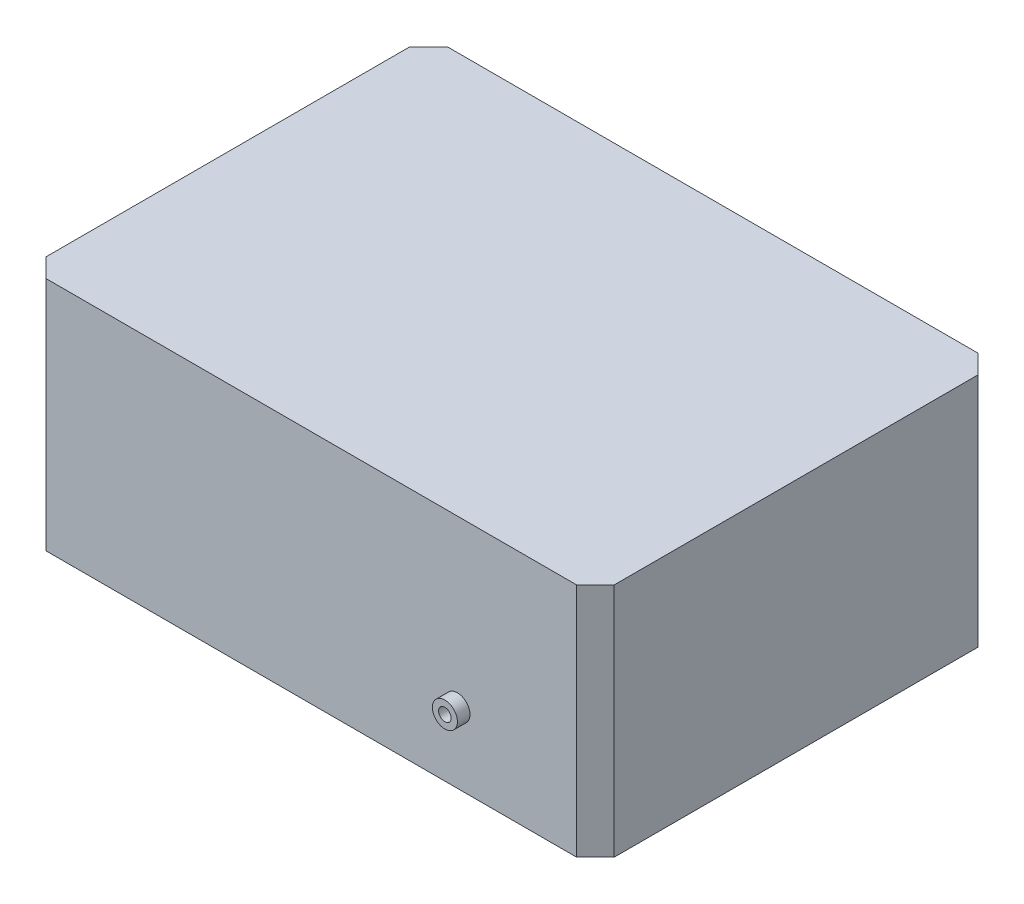
ISO-10303-21;
HEADER;
FILE_DESCRIPTION(('STEP AP214'),'2;1');
FILE_NAME('part.step','',(''),(''),'','','');
FILE_SCHEMA(('AUTOMOTIVE_DESIGN { 1 0 10303 214 1 1 1 1 }'));
ENDSEC;
DATA;
#1=APPLICATION_CONTEXT('core data for automotive mechanical design processes');
#2=APPLICATION_PROTOCOL_DEFINITION('international standard','automotive_design',2000,#1);
#3=PRODUCT_CONTEXT('',#1,'mechanical');
#4=PRODUCT('Part','Part','',(#3));
#5=PRODUCT_RELATED_PRODUCT_CATEGORY('part','',(#4));
#6=PRODUCT_DEFINITION_FORMATION('','',#4);
#7=PRODUCT_DEFINITION_CONTEXT('part definition',#1,'design');
#8=PRODUCT_DEFINITION('design','',#6,#7);
#9=PRODUCT_DEFINITION_SHAPE('','',#8);
#10=(LENGTH_UNIT() NAMED_UNIT(*) SI_UNIT(.MILLI.,.METRE.));
#11=(NAMED_UNIT(*) PLANE_ANGLE_UNIT() SI_UNIT($,.RADIAN.));
#12=(NAMED_UNIT(*) SI_UNIT($,.STERADIAN.) SOLID_ANGLE_UNIT());
#13=UNCERTAINTY_MEASURE_WITH_UNIT(LENGTH_MEASURE(1.E-05),#10,'distance_accuracy_value','');
#14=(GEOMETRIC_REPRESENTATION_CONTEXT(3) GLOBAL_UNCERTAINTY_ASSIGNED_CONTEXT((#13)) GLOBAL_UNIT_ASSIGNED_CONTEXT((#10,
#11,#12)) REPRESENTATION_CONTEXT('',''));
#15=CARTESIAN_POINT('',(0.,0.,0.));
#16=DIRECTION('',(0.,0.,1.));
#17=DIRECTION('',(1.,0.,0.));
#18=AXIS2_PLACEMENT_3D('',#15,#16,#17);
#19=CARTESIAN_POINT('',(0.,0.,160.));
#20=DIRECTION('',(0.,0.,-1.));
#21=DIRECTION('',(-1.,0.,0.));
#22=AXIS2_PLACEMENT_3D('',#19,#20,#21);
#23=CYLINDRICAL_SURFACE('',#22,5.);
#24=CARTESIAN_POINT('',(0.,0.,-170.));
#25=DIRECTION('',(0.,0.,-1.));
#26=DIRECTION('',(-1.,0.,0.));
#27=AXIS2_PLACEMENT_3D('',#24,#25,#26);
#28=CIRCLE('',#27,5.);
#29=CARTESIAN_POINT('',(-5.00000000000006,0.,-170.));
#30=VERTEX_POINT('',#29);
#31=EDGE_CURVE('E21',#30,#30,#28,.F.);
#32=ORIENTED_EDGE('',*,*,#31,.F.);
#33=EDGE_LOOP('',(#32));
#34=FACE_BOUND('',#33,.T.);
#35=CARTESIAN_POINT('',(0.,0.,170.));
#36=DIRECTION('',(0.,0.,-1.));
#37=DIRECTION('',(-1.,0.,0.));
#38=AXIS2_PLACEMENT_3D('',#35,#36,#37);
#39=CIRCLE('',#38,5.);
#40=CARTESIAN_POINT('',(-4.99999999999994,0.,170.));
#41=VERTEX_POINT('',#40);
#42=EDGE_CURVE('E123',#41,#41,#39,.T.);
#43=ORIENTED_EDGE('',*,*,#42,.F.);
#44=EDGE_LOOP('',(#43));
#45=FACE_BOUND('',#44,.T.);
#46=ADVANCED_FACE('F18',(#34,#45),#23,.F.);
#47=CARTESIAN_POINT('',(-116.5,38.,-170.));
#48=DIRECTION('',(0.,0.,-1.));
#49=DIRECTION('',(-1.,0.,0.));
#50=AXIS2_PLACEMENT_3D('',#47,#48,#49);
#51=PLANE('',#50);
#52=ORIENTED_EDGE('',*,*,#31,.T.);
#53=EDGE_LOOP('',(#52));
#54=FACE_BOUND('',#53,.T.);
#55=CARTESIAN_POINT('',(0.,0.,-170.));
#56=DIRECTION('',(0.,0.,1.));
#57=DIRECTION('',(1.,0.,0.));
#58=AXIS2_PLACEMENT_3D('',#55,#56,#57);
#59=CIRCLE('',#58,10.);
#60=CARTESIAN_POINT('',(9.99999999999994,0.,-170.));
#61=VERTEX_POINT('',#60);
#62=EDGE_CURVE('E121',#61,#61,#59,.T.);
#63=ORIENTED_EDGE('',*,*,#62,.F.);
#64=EDGE_LOOP('',(#63));
#65=FACE_BOUND('',#64,.T.);
#66=ADVANCED_FACE('F130',(#54,#65),#51,.T.);
#67=CARTESIAN_POINT('',(-116.5,38.,170.));
#68=DIRECTION('',(0.,0.,1.));
#69=DIRECTION('',(1.,0.,0.));
#70=AXIS2_PLACEMENT_3D('',#67,#68,#69);
#71=PLANE('',#70);
#72=ORIENTED_EDGE('',*,*,#42,.T.);
#73=EDGE_LOOP('',(#72));
#74=FACE_BOUND('',#73,.T.);
#75=CARTESIAN_POINT('',(0.,0.,170.));
#76=DIRECTION('',(0.,0.,-1.));
#77=DIRECTION('',(-1.,0.,0.));
#78=AXIS2_PLACEMENT_3D('',#75,#76,#77);
#79=CIRCLE('',#78,10.);
#80=CARTESIAN_POINT('',(-9.99999999999994,0.,170.));
#81=VERTEX_POINT('',#80);
#82=EDGE_CURVE('E102',#81,#81,#79,.T.);
#83=ORIENTED_EDGE('',*,*,#82,.F.);
#84=EDGE_LOOP('',(#83));
#85=FACE_BOUND('',#84,.T.);
#86=ADVANCED_FACE('F138',(#74,#85),#71,.T.);
#87=CARTESIAN_POINT('',(0.,0.,-170.));
#88=DIRECTION('',(0.,0.,1.));
#89=DIRECTION('',(1.,0.,0.));
#90=AXIS2_PLACEMENT_3D('',#87,#88,#89);
#91=CYLINDRICAL_SURFACE('',#90,10.);
#92=ORIENTED_EDGE('',*,*,#62,.T.);
#93=EDGE_LOOP('',(#92));
#94=FACE_BOUND('',#93,.T.);
#95=CARTESIAN_POINT('',(0.,0.,-160.));
#96=DIRECTION('',(0.,0.,1.));
#97=DIRECTION('',(1.,0.,0.));
#98=AXIS2_PLACEMENT_3D('',#95,#96,#97);
#99=CIRCLE('',#98,10.);
#100=CARTESIAN_POINT('',(9.99999999999994,0.,-160.));
#101=VERTEX_POINT('',#100);
#102=EDGE_CURVE('E115',#101,#101,#99,.F.);
#103=ORIENTED_EDGE('',*,*,#102,.T.);
#104=EDGE_LOOP('',(#103));
#105=FACE_BOUND('',#104,.T.);
#106=ADVANCED_FACE('F179',(#94,#105),#91,.T.);
#107=CARTESIAN_POINT('',(0.,0.,170.));
#108=DIRECTION('',(0.,0.,-1.));
#109=DIRECTION('',(-1.,0.,0.));
#110=AXIS2_PLACEMENT_3D('',#107,#108,#109);
#111=CYLINDRICAL_SURFACE('',#110,10.);
#112=ORIENTED_EDGE('',*,*,#82,.T.);
#113=EDGE_LOOP('',(#112));
#114=FACE_BOUND('',#113,.T.);
#115=CARTESIAN_POINT('',(0.,0.,160.));
#116=DIRECTION('',(0.,0.,-1.));
#117=DIRECTION('',(-1.,0.,0.));
#118=AXIS2_PLACEMENT_3D('',#115,#116,#117);
#119=CIRCLE('',#118,10.);
#120=CARTESIAN_POINT('',(-9.99999999999994,0.,160.));
#121=VERTEX_POINT('',#120);
#122=EDGE_CURVE('E111',#121,#121,#119,.F.);
#123=ORIENTED_EDGE('',*,*,#122,.T.);
#124=EDGE_LOOP('',(#123));
#125=FACE_BOUND('',#124,.T.);
#126=ADVANCED_FACE('F176',(#114,#125),#111,.T.);
#127=CARTESIAN_POINT('',(-116.5,-56.,0.));
#128=DIRECTION('',(0.,-1.,0.));
#129=DIRECTION('',(0.,0.,-1.));
#130=AXIS2_PLACEMENT_3D('',#127,#128,#129);
#131=PLANE('',#130);
#132=DIRECTION('',(1.,0.,0.));
#133=VECTOR('',#132,1.);
#134=CARTESIAN_POINT('',(-116.5,-56.,-160.));
#135=LINE('',#134,#133);
#136=CARTESIAN_POINT('',(-328.,-56.,-160.));
#137=VERTEX_POINT('',#136);
#138=CARTESIAN_POINT('',(95.0000000000001,-56.,-160.));
#139=VERTEX_POINT('',#138);
#140=EDGE_CURVE('E79',#137,#139,#135,.T.);
#141=ORIENTED_EDGE('',*,*,#140,.T.);
#142=DIRECTION('',(0.707106781186548,0.,0.707106781186547));
#143=VECTOR('',#142,1.);
#144=CARTESIAN_POINT('',(110.,-56.,-145.));
#145=LINE('',#144,#143);
#146=CARTESIAN_POINT('',(110.,-56.,-145.));
#147=VERTEX_POINT('',#146);
#148=EDGE_CURVE('E118',#139,#147,#145,.T.);
#149=ORIENTED_EDGE('',*,*,#148,.T.);
#150=DIRECTION('',(0.,0.,1.));
#151=VECTOR('',#150,1.);
#152=CARTESIAN_POINT('',(110.,-56.,-80.));
#153=LINE('',#152,#151);
#154=CARTESIAN_POINT('',(110.,-56.,145.));
#155=VERTEX_POINT('',#154);
#156=EDGE_CURVE('E212',#147,#155,#153,.T.);
#157=ORIENTED_EDGE('',*,*,#156,.T.);
#158=DIRECTION('',(-0.707106781186547,0.,0.707106781186548));
#159=VECTOR('',#158,1.);
#160=CARTESIAN_POINT('',(95.0000000000001,-56.,160.));
#161=LINE('',#160,#159);
#162=CARTESIAN_POINT('',(95.0000000000001,-56.,160.));
#163=VERTEX_POINT('',#162);
#164=EDGE_CURVE('E198',#155,#163,#161,.T.);
#165=ORIENTED_EDGE('',*,*,#164,.T.);
#166=DIRECTION('',(-1.,0.,0.));
#167=VECTOR('',#166,1.);
#168=CARTESIAN_POINT('',(-116.5,-56.,160.));
#169=LINE('',#168,#167);
#170=CARTESIAN_POINT('',(-328.,-56.,160.));
#171=VERTEX_POINT('',#170);
#172=EDGE_CURVE('E114',#163,#171,#169,.T.);
#173=ORIENTED_EDGE('',*,*,#172,.T.);
#174=DIRECTION('',(-0.707106781186547,0.,-0.707106781186548));
#175=VECTOR('',#174,1.);
#176=CARTESIAN_POINT('',(-343.,-56.,145.));
#177=LINE('',#176,#175);
#178=CARTESIAN_POINT('',(-343.,-56.,145.));
#179=VERTEX_POINT('',#178);
#180=EDGE_CURVE('E98',#171,#179,#177,.T.);
#181=ORIENTED_EDGE('',*,*,#180,.T.);
#182=DIRECTION('',(0.,0.,-1.));
#183=VECTOR('',#182,1.);
#184=CARTESIAN_POINT('',(-343.,-56.,0.));
#185=LINE('',#184,#183);
#186=CARTESIAN_POINT('',(-343.,-56.,-145.));
#187=VERTEX_POINT('',#186);
#188=EDGE_CURVE('E93',#179,#187,#185,.T.);
#189=ORIENTED_EDGE('',*,*,#188,.T.);
#190=DIRECTION('',(0.707106781186547,0.,-0.707106781186548));
#191=VECTOR('',#190,1.);
#192=CARTESIAN_POINT('',(-328.,-56.,-160.));
#193=LINE('',#192,#191);
#194=EDGE_CURVE('E84',#187,#137,#193,.T.);
#195=ORIENTED_EDGE('',*,*,#194,.T.);
#196=EDGE_LOOP('',(#141,#149,#157,#165,#173,#181,#189,#195));
#197=FACE_BOUND('',#196,.T.);
#198=ADVANCED_FACE('F96',(#197),#131,.T.);
#199=CARTESIAN_POINT('',(-343.,-56.,0.));
#200=DIRECTION('',(1.,0.,0.));
#201=DIRECTION('',(0.,0.,-1.));
#202=AXIS2_PLACEMENT_3D('',#199,#200,#201);
#203=PLANE('',#202);
#204=DIRECTION('',(0.,0.,-1.));
#205=VECTOR('',#204,1.);
#206=CARTESIAN_POINT('',(-343.,132.,0.));
#207=LINE('',#206,#205);
#208=CARTESIAN_POINT('',(-343.,132.,145.));
#209=VERTEX_POINT('',#208);
#210=CARTESIAN_POINT('',(-343.,132.,-145.));
#211=VERTEX_POINT('',#210);
#212=EDGE_CURVE('E106',#209,#211,#207,.T.);
#213=ORIENTED_EDGE('',*,*,#212,.T.);
#214=DIRECTION('',(0.,1.,0.));
#215=VECTOR('',#214,1.);
#216=CARTESIAN_POINT('',(-343.,-56.,-145.));
#217=LINE('',#216,#215);
#218=EDGE_CURVE('E89',#211,#187,#217,.F.);
#219=ORIENTED_EDGE('',*,*,#218,.T.);
#220=ORIENTED_EDGE('',*,*,#188,.F.);
#221=DIRECTION('',(0.,1.,0.));
#222=VECTOR('',#221,1.);
#223=CARTESIAN_POINT('',(-343.,-56.,145.));
#224=LINE('',#223,#222);
#225=EDGE_CURVE('E236',#179,#209,#224,.T.);
#226=ORIENTED_EDGE('',*,*,#225,.T.);
#227=EDGE_LOOP('',(#213,#219,#220,#226));
#228=FACE_BOUND('',#227,.T.);
#229=ADVANCED_FACE('F105',(#228),#203,.F.);
#230=CARTESIAN_POINT('',(-328.,-56.,-160.));
#231=DIRECTION('',(0.707106781186548,0.,0.707106781186547));
#232=DIRECTION('',(0.707106781186547,0.,-0.707106781186548));
#233=AXIS2_PLACEMENT_3D('',#230,#231,#232);
#234=PLANE('',#233);
#235=DIRECTION('',(0.707106781186549,0.,-0.707106781186545));
#236=VECTOR('',#235,1.);
#237=CARTESIAN_POINT('',(-343.,132.,-145.));
#238=LINE('',#237,#236);
#239=CARTESIAN_POINT('',(-328.,132.,-160.));
#240=VERTEX_POINT('',#239);
#241=EDGE_CURVE('E232',#211,#240,#238,.T.);
#242=ORIENTED_EDGE('',*,*,#241,.T.);
#243=DIRECTION('',(0.,1.,0.));
#244=VECTOR('',#243,1.);
#245=CARTESIAN_POINT('',(-328.,-56.,-160.));
#246=LINE('',#245,#244);
#247=EDGE_CURVE('E91',#240,#137,#246,.F.);
#248=ORIENTED_EDGE('',*,*,#247,.T.);
#249=ORIENTED_EDGE('',*,*,#194,.F.);
#250=ORIENTED_EDGE('',*,*,#218,.F.);
#251=EDGE_LOOP('',(#242,#248,#249,#250));
#252=FACE_BOUND('',#251,.T.);
#253=ADVANCED_FACE('F87',(#252),#234,.F.);
#254=CARTESIAN_POINT('',(-116.5,-56.,-160.));
#255=DIRECTION('',(0.,0.,1.));
#256=DIRECTION('',(1.,0.,0.));
#257=AXIS2_PLACEMENT_3D('',#254,#255,#256);
#258=PLANE('',#257);
#259=ORIENTED_EDGE('',*,*,#102,.F.);
#260=EDGE_LOOP('',(#259));
#261=FACE_BOUND('',#260,.T.);
#262=DIRECTION('',(1.,0.,0.));
#263=VECTOR('',#262,1.);
#264=CARTESIAN_POINT('',(-116.5,132.,-160.));
#265=LINE('',#264,#263);
#266=CARTESIAN_POINT('',(95.0000000000001,132.,-160.));
#267=VERTEX_POINT('',#266);
#268=EDGE_CURVE('E227',#240,#267,#265,.T.);
#269=ORIENTED_EDGE('',*,*,#268,.T.);
#270=DIRECTION('',(0.,1.,0.));
#271=VECTOR('',#270,1.);
#272=CARTESIAN_POINT('',(95.,-56.,-160.));
#273=LINE('',#272,#271);
#274=EDGE_CURVE('E214',#267,#139,#273,.F.);
#275=ORIENTED_EDGE('',*,*,#274,.T.);
#276=ORIENTED_EDGE('',*,*,#140,.F.);
#277=ORIENTED_EDGE('',*,*,#247,.F.);
#278=EDGE_LOOP('',(#269,#275,#276,#277));
#279=FACE_BOUND('',#278,.T.);
#280=ADVANCED_FACE('F165',(#261,#279),#258,.F.);
#281=CARTESIAN_POINT('',(110.,-56.,-145.));
#282=DIRECTION('',(-0.707106781186547,0.,0.707106781186548));
#283=DIRECTION('',(0.707106781186548,0.,0.707106781186547));
#284=AXIS2_PLACEMENT_3D('',#281,#282,#283);
#285=PLANE('',#284);
#286=DIRECTION('',(0.707106781186546,0.,0.707106781186549));
#287=VECTOR('',#286,1.);
#288=CARTESIAN_POINT('',(95.,132.,-160.));
#289=LINE('',#288,#287);
#290=CARTESIAN_POINT('',(110.,132.,-145.));
#291=VERTEX_POINT('',#290);
#292=EDGE_CURVE('E219',#267,#291,#289,.T.);
#293=ORIENTED_EDGE('',*,*,#292,.T.);
#294=DIRECTION('',(0.,1.,0.));
#295=VECTOR('',#294,1.);
#296=CARTESIAN_POINT('',(110.,-56.,-145.));
#297=LINE('',#296,#295);
#298=EDGE_CURVE('E209',#291,#147,#297,.F.);
#299=ORIENTED_EDGE('',*,*,#298,.T.);
#300=ORIENTED_EDGE('',*,*,#148,.F.);
#301=ORIENTED_EDGE('',*,*,#274,.F.);
#302=EDGE_LOOP('',(#293,#299,#300,#301));
#303=FACE_BOUND('',#302,.T.);
#304=ADVANCED_FACE('F161',(#303),#285,.F.);
#305=CARTESIAN_POINT('',(110.,-56.,-80.));
#306=DIRECTION('',(-1.,0.,0.));
#307=DIRECTION('',(0.,0.,1.));
#308=AXIS2_PLACEMENT_3D('',#305,#306,#307);
#309=PLANE('',#308);
#310=DIRECTION('',(0.,0.,-1.));
#311=VECTOR('',#310,1.);
#312=CARTESIAN_POINT('',(110.,132.,0.));
#313=LINE('',#312,#311);
#314=CARTESIAN_POINT('',(110.,132.,145.));
#315=VERTEX_POINT('',#314);
#316=EDGE_CURVE('E222',#291,#315,#313,.F.);
#317=ORIENTED_EDGE('',*,*,#316,.T.);
#318=DIRECTION('',(0.,1.,0.));
#319=VECTOR('',#318,1.);
#320=CARTESIAN_POINT('',(110.,-56.,145.));
#321=LINE('',#320,#319);
#322=EDGE_CURVE('E202',#315,#155,#321,.F.);
#323=ORIENTED_EDGE('',*,*,#322,.T.);
#324=ORIENTED_EDGE('',*,*,#156,.F.);
#325=ORIENTED_EDGE('',*,*,#298,.F.);
#326=EDGE_LOOP('',(#317,#323,#324,#325));
#327=FACE_BOUND('',#326,.T.);
#328=ADVANCED_FACE('F157',(#327),#309,.F.);
#329=CARTESIAN_POINT('',(95.0000000000001,-56.,160.));
#330=DIRECTION('',(-0.707106781186548,0.,-0.707106781186547));
#331=DIRECTION('',(-0.707106781186547,0.,0.707106781186548));
#332=AXIS2_PLACEMENT_3D('',#329,#330,#331);
#333=PLANE('',#332);
#334=DIRECTION('',(-0.707106781186546,0.,0.707106781186549));
#335=VECTOR('',#334,1.);
#336=CARTESIAN_POINT('',(110.,132.,145.));
#337=LINE('',#336,#335);
#338=CARTESIAN_POINT('',(95.0000000000001,132.,160.));
#339=VERTEX_POINT('',#338);
#340=EDGE_CURVE('E201',#315,#339,#337,.T.);
#341=ORIENTED_EDGE('',*,*,#340,.T.);
#342=DIRECTION('',(0.,1.,0.));
#343=VECTOR('',#342,1.);
#344=CARTESIAN_POINT('',(95.0000000000001,-56.,160.));
#345=LINE('',#344,#343);
#346=EDGE_CURVE('E195',#339,#163,#345,.F.);
#347=ORIENTED_EDGE('',*,*,#346,.T.);
#348=ORIENTED_EDGE('',*,*,#164,.F.);
#349=ORIENTED_EDGE('',*,*,#322,.F.);
#350=EDGE_LOOP('',(#341,#347,#348,#349));
#351=FACE_BOUND('',#350,.T.);
#352=ADVANCED_FACE('F153',(#351),#333,.F.);
#353=CARTESIAN_POINT('',(-116.5,-56.,160.));
#354=DIRECTION('',(0.,0.,-1.));
#355=DIRECTION('',(-1.,0.,0.));
#356=AXIS2_PLACEMENT_3D('',#353,#354,#355);
#357=PLANE('',#356);
#358=ORIENTED_EDGE('',*,*,#122,.F.);
#359=EDGE_LOOP('',(#358));
#360=FACE_BOUND('',#359,.T.);
#361=ORIENTED_EDGE('',*,*,#172,.F.);
#362=ORIENTED_EDGE('',*,*,#346,.F.);
#363=DIRECTION('',(1.,0.,0.));
#364=VECTOR('',#363,1.);
#365=CARTESIAN_POINT('',(-116.5,132.,160.));
#366=LINE('',#365,#364);
#367=CARTESIAN_POINT('',(-328.,132.,160.));
#368=VERTEX_POINT('',#367);
#369=EDGE_CURVE('E27',#339,#368,#366,.F.);
#370=ORIENTED_EDGE('',*,*,#369,.T.);
#371=DIRECTION('',(0.,1.,0.));
#372=VECTOR('',#371,1.);
#373=CARTESIAN_POINT('',(-328.,-56.,160.));
#374=LINE('',#373,#372);
#375=EDGE_CURVE('E35',#368,#171,#374,.F.);
#376=ORIENTED_EDGE('',*,*,#375,.T.);
#377=EDGE_LOOP('',(#361,#362,#370,#376));
#378=FACE_BOUND('',#377,.T.);
#379=ADVANCED_FACE('F147',(#360,#378),#357,.F.);
#380=CARTESIAN_POINT('',(-343.,-56.,145.));
#381=DIRECTION('',(0.707106781186548,0.,-0.707106781186547));
#382=DIRECTION('',(-0.707106781186547,0.,-0.707106781186548));
#383=AXIS2_PLACEMENT_3D('',#380,#381,#382);
#384=PLANE('',#383);
#385=DIRECTION('',(-0.707106781186548,0.,-0.707106781186547));
#386=VECTOR('',#385,1.);
#387=CARTESIAN_POINT('',(-328.,132.,160.));
#388=LINE('',#387,#386);
#389=EDGE_CURVE('E11',#368,#209,#388,.T.);
#390=ORIENTED_EDGE('',*,*,#389,.T.);
#391=ORIENTED_EDGE('',*,*,#225,.F.);
#392=ORIENTED_EDGE('',*,*,#180,.F.);
#393=ORIENTED_EDGE('',*,*,#375,.F.);
#394=EDGE_LOOP('',(#390,#391,#392,#393));
#395=FACE_BOUND('',#394,.T.);
#396=ADVANCED_FACE('F141',(#395),#384,.F.);
#397=CARTESIAN_POINT('',(-116.5,132.,0.));
#398=DIRECTION('',(0.,-1.,0.));
#399=DIRECTION('',(0.,0.,-1.));
#400=AXIS2_PLACEMENT_3D('',#397,#398,#399);
#401=PLANE('',#400);
#402=ORIENTED_EDGE('',*,*,#369,.F.);
#403=ORIENTED_EDGE('',*,*,#340,.F.);
#404=ORIENTED_EDGE('',*,*,#316,.F.);
#405=ORIENTED_EDGE('',*,*,#292,.F.);
#406=ORIENTED_EDGE('',*,*,#268,.F.);
#407=ORIENTED_EDGE('',*,*,#241,.F.);
#408=ORIENTED_EDGE('',*,*,#212,.F.);
#409=ORIENTED_EDGE('',*,*,#389,.F.);
#410=EDGE_LOOP('',(#402,#403,#404,#405,#406,#407,#408,#409));
#411=FACE_BOUND('',#410,.T.);
#412=ADVANCED_FACE('F139',(#411),#401,.F.);
#413=CLOSED_SHELL('',(#46,#66,#86,#106,#126,#198,#229,#253,#280,#304,#328,#352,#379,#396,#412));
#414=MANIFOLD_SOLID_BREP('B1',#413);
#415=ADVANCED_BREP_SHAPE_REPRESENTATION('',(#18,#414),#14);
#416=SHAPE_DEFINITION_REPRESENTATION(#9,#415);
ENDSEC;
END-ISO-10303-21;
